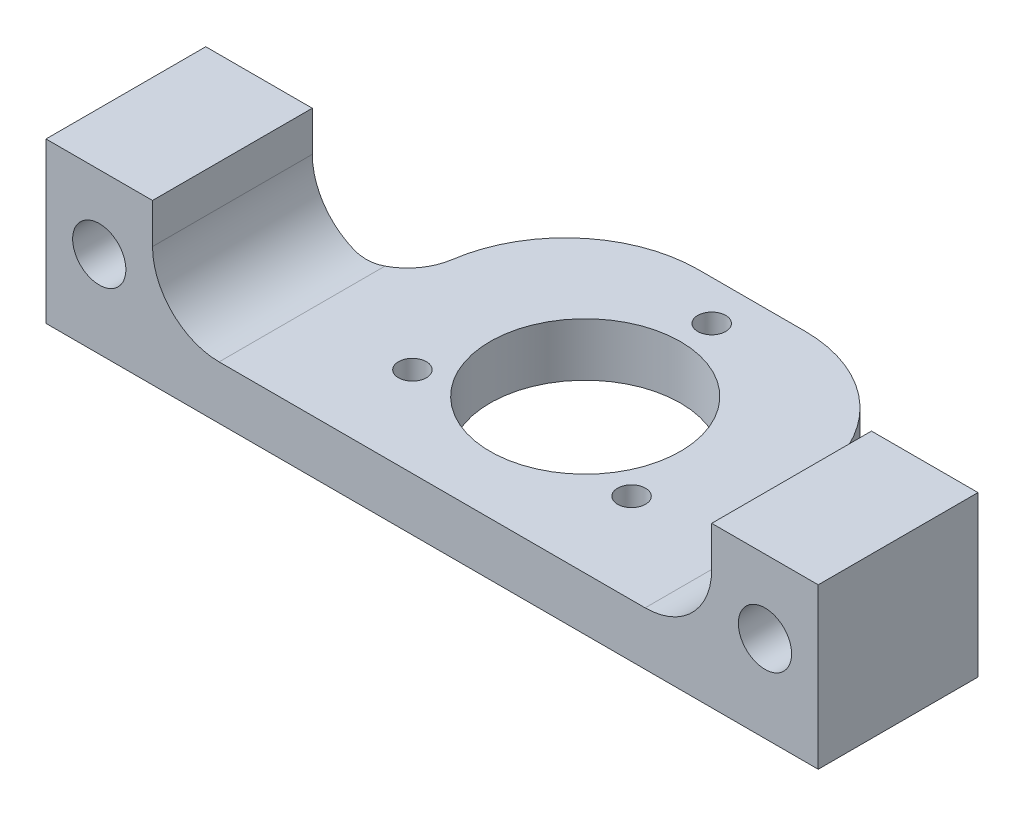
ISO-10303-21;
HEADER;
FILE_DESCRIPTION(('STEP AP214'),'2;1');
FILE_NAME('part.step','',(''),(''),'','','');
FILE_SCHEMA(('AUTOMOTIVE_DESIGN { 1 0 10303 214 1 1 1 1 }'));
ENDSEC;
DATA;
#1=APPLICATION_CONTEXT('core data for automotive mechanical design processes');
#2=APPLICATION_PROTOCOL_DEFINITION('international standard','automotive_design',2000,#1);
#3=PRODUCT_CONTEXT('',#1,'mechanical');
#4=PRODUCT('Part','Part','',(#3));
#5=PRODUCT_RELATED_PRODUCT_CATEGORY('part','',(#4));
#6=PRODUCT_DEFINITION_FORMATION('','',#4);
#7=PRODUCT_DEFINITION_CONTEXT('part definition',#1,'design');
#8=PRODUCT_DEFINITION('design','',#6,#7);
#9=PRODUCT_DEFINITION_SHAPE('','',#8);
#10=(LENGTH_UNIT() NAMED_UNIT(*) SI_UNIT(.MILLI.,.METRE.));
#11=(NAMED_UNIT(*) PLANE_ANGLE_UNIT() SI_UNIT($,.RADIAN.));
#12=(NAMED_UNIT(*) SI_UNIT($,.STERADIAN.) SOLID_ANGLE_UNIT());
#13=UNCERTAINTY_MEASURE_WITH_UNIT(LENGTH_MEASURE(1.E-05),#10,'distance_accuracy_value','');
#14=(GEOMETRIC_REPRESENTATION_CONTEXT(3) GLOBAL_UNCERTAINTY_ASSIGNED_CONTEXT((#13)) GLOBAL_UNIT_ASSIGNED_CONTEXT((#10,
#11,#12)) REPRESENTATION_CONTEXT('',''));
#15=CARTESIAN_POINT('',(0.,0.,0.));
#16=DIRECTION('',(0.,0.,1.));
#17=DIRECTION('',(1.,0.,0.));
#18=AXIS2_PLACEMENT_3D('',#15,#16,#17);
#19=CARTESIAN_POINT('',(0.,6.,3.));
#20=DIRECTION('',(0.,-1.,0.));
#21=DIRECTION('',(0.,0.,-1.));
#22=AXIS2_PLACEMENT_3D('',#19,#20,#21);
#23=CYLINDRICAL_SURFACE('',#22,1.05);
#24=CARTESIAN_POINT('',(0.,-2.,3.));
#25=DIRECTION('',(0.,-1.,0.));
#26=DIRECTION('',(0.,0.,-1.));
#27=AXIS2_PLACEMENT_3D('',#24,#25,#26);
#28=CIRCLE('',#27,1.05);
#29=CARTESIAN_POINT('',(0.,-2.,1.95));
#30=VERTEX_POINT('',#29);
#31=EDGE_CURVE('E194',#30,#30,#28,.T.);
#32=ORIENTED_EDGE('',*,*,#31,.F.);
#33=EDGE_LOOP('',(#32));
#34=FACE_BOUND('',#33,.T.);
#35=CARTESIAN_POINT('',(0.,-4.5,3.));
#36=DIRECTION('',(0.,-1.,0.));
#37=DIRECTION('',(0.,0.,-1.));
#38=AXIS2_PLACEMENT_3D('',#35,#36,#37);
#39=CIRCLE('',#38,1.05);
#40=CARTESIAN_POINT('',(0.,-4.5,1.95));
#41=VERTEX_POINT('',#40);
#42=EDGE_CURVE('E219',#41,#41,#39,.F.);
#43=ORIENTED_EDGE('',*,*,#42,.F.);
#44=EDGE_LOOP('',(#43));
#45=FACE_BOUND('',#44,.T.);
#46=ADVANCED_FACE('F33',(#34,#45),#23,.F.);
#47=CARTESIAN_POINT('',(8.2272413359522,6.,17.25));
#48=DIRECTION('',(0.,-1.,0.));
#49=DIRECTION('',(0.,0.,-1.));
#50=AXIS2_PLACEMENT_3D('',#47,#48,#49);
#51=CYLINDRICAL_SURFACE('',#50,1.05);
#52=CARTESIAN_POINT('',(8.2272413359522,-2.,17.25));
#53=DIRECTION('',(0.,-1.,0.));
#54=DIRECTION('',(0.,0.,-1.));
#55=AXIS2_PLACEMENT_3D('',#52,#53,#54);
#56=CIRCLE('',#55,1.05);
#57=CARTESIAN_POINT('',(8.2272413359522,-2.,16.2));
#58=VERTEX_POINT('',#57);
#59=EDGE_CURVE('E190',#58,#58,#56,.T.);
#60=ORIENTED_EDGE('',*,*,#59,.F.);
#61=EDGE_LOOP('',(#60));
#62=FACE_BOUND('',#61,.T.);
#63=CARTESIAN_POINT('',(8.2272413359522,-4.5,17.25));
#64=DIRECTION('',(0.,-1.,0.));
#65=DIRECTION('',(0.,0.,-1.));
#66=AXIS2_PLACEMENT_3D('',#63,#64,#65);
#67=CIRCLE('',#66,1.05);
#68=CARTESIAN_POINT('',(8.2272413359522,-4.5,16.2));
#69=VERTEX_POINT('',#68);
#70=EDGE_CURVE('E216',#69,#69,#67,.F.);
#71=ORIENTED_EDGE('',*,*,#70,.F.);
#72=EDGE_LOOP('',(#71));
#73=FACE_BOUND('',#72,.T.);
#74=ADVANCED_FACE('F275',(#62,#73),#51,.F.);
#75=CARTESIAN_POINT('',(-8.22724133595217,6.,17.25));
#76=DIRECTION('',(0.,-1.,0.));
#77=DIRECTION('',(0.,0.,-1.));
#78=AXIS2_PLACEMENT_3D('',#75,#76,#77);
#79=CYLINDRICAL_SURFACE('',#78,1.05);
#80=CARTESIAN_POINT('',(-8.22724133595217,-2.,17.25));
#81=DIRECTION('',(0.,-1.,0.));
#82=DIRECTION('',(0.,0.,-1.));
#83=AXIS2_PLACEMENT_3D('',#80,#81,#82);
#84=CIRCLE('',#83,1.05);
#85=CARTESIAN_POINT('',(-8.22724133595217,-2.,16.2));
#86=VERTEX_POINT('',#85);
#87=EDGE_CURVE('E187',#86,#86,#84,.T.);
#88=ORIENTED_EDGE('',*,*,#87,.F.);
#89=EDGE_LOOP('',(#88));
#90=FACE_BOUND('',#89,.T.);
#91=CARTESIAN_POINT('',(-8.22724133595217,-4.5,17.25));
#92=DIRECTION('',(0.,-1.,0.));
#93=DIRECTION('',(0.,0.,-1.));
#94=AXIS2_PLACEMENT_3D('',#91,#92,#93);
#95=CIRCLE('',#94,1.05);
#96=CARTESIAN_POINT('',(-8.22724133595217,-4.5,16.2));
#97=VERTEX_POINT('',#96);
#98=EDGE_CURVE('E212',#97,#97,#95,.F.);
#99=ORIENTED_EDGE('',*,*,#98,.F.);
#100=EDGE_LOOP('',(#99));
#101=FACE_BOUND('',#100,.T.);
#102=ADVANCED_FACE('F281',(#90,#101),#79,.F.);
#103=CARTESIAN_POINT('',(-29.,6.,24.));
#104=DIRECTION('',(0.,-1.,0.));
#105=DIRECTION('',(0.,0.,-1.));
#106=AXIS2_PLACEMENT_3D('',#103,#104,#105);
#107=PLANE('',#106);
#108=DIRECTION('',(0.,0.,1.));
#109=VECTOR('',#108,1.);
#110=CARTESIAN_POINT('',(-21.,6.,0.));
#111=LINE('',#110,#109);
#112=CARTESIAN_POINT('',(-21.,6.,12.));
#113=VERTEX_POINT('',#112);
#114=CARTESIAN_POINT('',(-21.,6.,24.));
#115=VERTEX_POINT('',#114);
#116=EDGE_CURVE('E412',#113,#115,#111,.T.);
#117=ORIENTED_EDGE('',*,*,#116,.F.);
#118=DIRECTION('',(-1.,0.,0.));
#119=VECTOR('',#118,1.);
#120=CARTESIAN_POINT('',(-29.,6.,12.));
#121=LINE('',#120,#119);
#122=CARTESIAN_POINT('',(-29.,6.,12.));
#123=VERTEX_POINT('',#122);
#124=EDGE_CURVE('E391',#113,#123,#121,.T.);
#125=ORIENTED_EDGE('',*,*,#124,.T.);
#126=DIRECTION('',(0.,0.,-1.));
#127=VECTOR('',#126,1.);
#128=CARTESIAN_POINT('',(-29.,6.,24.));
#129=LINE('',#128,#127);
#130=CARTESIAN_POINT('',(-29.,6.,24.));
#131=VERTEX_POINT('',#130);
#132=EDGE_CURVE('E178',#131,#123,#129,.T.);
#133=ORIENTED_EDGE('',*,*,#132,.F.);
#134=DIRECTION('',(-1.,0.,0.));
#135=VECTOR('',#134,1.);
#136=CARTESIAN_POINT('',(-29.,6.,24.));
#137=LINE('',#136,#135);
#138=EDGE_CURVE('E424',#115,#131,#137,.T.);
#139=ORIENTED_EDGE('',*,*,#138,.F.);
#140=EDGE_LOOP('',(#117,#125,#133,#139));
#141=FACE_BOUND('',#140,.T.);
#142=ADVANCED_FACE('F295',(#141),#107,.F.);
#143=CARTESIAN_POINT('',(0.,0.,24.));
#144=DIRECTION('',(0.,0.,-1.));
#145=DIRECTION('',(-1.,0.,0.));
#146=AXIS2_PLACEMENT_3D('',#143,#144,#145);
#147=PLANE('',#146);
#148=DIRECTION('',(1.,0.,0.));
#149=VECTOR('',#148,1.);
#150=CARTESIAN_POINT('',(-21.,-2.,24.));
#151=LINE('',#150,#149);
#152=CARTESIAN_POINT('',(-16.,-2.,24.));
#153=VERTEX_POINT('',#152);
#154=CARTESIAN_POINT('',(16.,-2.,24.));
#155=VERTEX_POINT('',#154);
#156=EDGE_CURVE('E409',#153,#155,#151,.T.);
#157=ORIENTED_EDGE('',*,*,#156,.F.);
#158=CARTESIAN_POINT('',(-16.,3.,24.));
#159=DIRECTION('',(0.,0.,-1.));
#160=DIRECTION('',(-1.,0.,0.));
#161=AXIS2_PLACEMENT_3D('',#158,#159,#160);
#162=CIRCLE('',#161,5.);
#163=CARTESIAN_POINT('',(-21.,3.,24.));
#164=VERTEX_POINT('',#163);
#165=EDGE_CURVE('E231',#153,#164,#162,.T.);
#166=ORIENTED_EDGE('',*,*,#165,.T.);
#167=DIRECTION('',(0.,-1.,0.));
#168=VECTOR('',#167,1.);
#169=CARTESIAN_POINT('',(-21.,6.,24.));
#170=LINE('',#169,#168);
#171=EDGE_CURVE('E402',#115,#164,#170,.T.);
#172=ORIENTED_EDGE('',*,*,#171,.F.);
#173=ORIENTED_EDGE('',*,*,#138,.T.);
#174=DIRECTION('',(0.,-1.,0.));
#175=VECTOR('',#174,1.);
#176=CARTESIAN_POINT('',(-29.,-6.,24.));
#177=LINE('',#176,#175);
#178=CARTESIAN_POINT('',(-29.,-6.,24.));
#179=VERTEX_POINT('',#178);
#180=EDGE_CURVE('E426',#131,#179,#177,.T.);
#181=ORIENTED_EDGE('',*,*,#180,.T.);
#182=DIRECTION('',(1.,0.,0.));
#183=VECTOR('',#182,1.);
#184=CARTESIAN_POINT('',(-29.,-6.,24.));
#185=LINE('',#184,#183);
#186=CARTESIAN_POINT('',(29.,-6.,24.));
#187=VERTEX_POINT('',#186);
#188=EDGE_CURVE('E428',#179,#187,#185,.T.);
#189=ORIENTED_EDGE('',*,*,#188,.T.);
#190=DIRECTION('',(0.,1.,0.));
#191=VECTOR('',#190,1.);
#192=CARTESIAN_POINT('',(29.,-6.,24.));
#193=LINE('',#192,#191);
#194=CARTESIAN_POINT('',(29.,6.,24.));
#195=VERTEX_POINT('',#194);
#196=EDGE_CURVE('E422',#187,#195,#193,.T.);
#197=ORIENTED_EDGE('',*,*,#196,.T.);
#198=CARTESIAN_POINT('',(21.,6.,24.));
#199=VERTEX_POINT('',#198);
#200=EDGE_CURVE('E175',#195,#199,#137,.T.);
#201=ORIENTED_EDGE('',*,*,#200,.T.);
#202=DIRECTION('',(0.,1.,0.));
#203=VECTOR('',#202,1.);
#204=CARTESIAN_POINT('',(21.,6.,24.));
#205=LINE('',#204,#203);
#206=CARTESIAN_POINT('',(21.,3.,24.));
#207=VERTEX_POINT('',#206);
#208=EDGE_CURVE('E406',#207,#199,#205,.T.);
#209=ORIENTED_EDGE('',*,*,#208,.F.);
#210=CARTESIAN_POINT('',(16.,3.,24.));
#211=DIRECTION('',(0.,0.,-1.));
#212=DIRECTION('',(-1.,0.,0.));
#213=AXIS2_PLACEMENT_3D('',#210,#211,#212);
#214=CIRCLE('',#213,5.);
#215=EDGE_CURVE('E236',#207,#155,#214,.T.);
#216=ORIENTED_EDGE('',*,*,#215,.T.);
#217=EDGE_LOOP('',(#157,#166,#172,#173,#181,#189,#197,#201,#209,#216));
#218=FACE_BOUND('',#217,.T.);
#219=CARTESIAN_POINT('',(-25.,0.5,24.));
#220=DIRECTION('',(0.,0.,1.));
#221=DIRECTION('',(1.,0.,0.));
#222=AXIS2_PLACEMENT_3D('',#219,#220,#221);
#223=CIRCLE('',#222,2.);
#224=CARTESIAN_POINT('',(-23.,0.5,24.));
#225=VERTEX_POINT('',#224);
#226=EDGE_CURVE('E418',#225,#225,#223,.T.);
#227=ORIENTED_EDGE('',*,*,#226,.F.);
#228=EDGE_LOOP('',(#227));
#229=FACE_BOUND('',#228,.T.);
#230=CARTESIAN_POINT('',(25.,0.5,24.));
#231=DIRECTION('',(0.,0.,1.));
#232=DIRECTION('',(1.,0.,0.));
#233=AXIS2_PLACEMENT_3D('',#230,#231,#232);
#234=CIRCLE('',#233,2.);
#235=CARTESIAN_POINT('',(27.,0.5,24.));
#236=VERTEX_POINT('',#235);
#237=EDGE_CURVE('E414',#236,#236,#234,.T.);
#238=ORIENTED_EDGE('',*,*,#237,.F.);
#239=EDGE_LOOP('',(#238));
#240=FACE_BOUND('',#239,.T.);
#241=ADVANCED_FACE('F325',(#218,#229,#240),#147,.F.);
#242=CARTESIAN_POINT('',(0.,0.,0.));
#243=DIRECTION('',(0.,0.,-1.));
#244=DIRECTION('',(-1.,0.,0.));
#245=AXIS2_PLACEMENT_3D('',#242,#243,#244);
#246=PLANE('',#245);
#247=DIRECTION('',(1.,0.,0.));
#248=VECTOR('',#247,1.);
#249=CARTESIAN_POINT('',(-21.,-2.,0.));
#250=LINE('',#249,#248);
#251=CARTESIAN_POINT('',(-4.00000000000001,-2.,0.));
#252=VERTEX_POINT('',#251);
#253=CARTESIAN_POINT('',(3.99999999999999,-2.,0.));
#254=VERTEX_POINT('',#253);
#255=EDGE_CURVE('E403',#252,#254,#250,.T.);
#256=ORIENTED_EDGE('',*,*,#255,.T.);
#257=DIRECTION('',(0.,-1.,0.));
#258=VECTOR('',#257,1.);
#259=CARTESIAN_POINT('',(4.,-6.,0.));
#260=LINE('',#259,#258);
#261=CARTESIAN_POINT('',(3.99999999999999,-6.,0.));
#262=VERTEX_POINT('',#261);
#263=EDGE_CURVE('E180',#254,#262,#260,.T.);
#264=ORIENTED_EDGE('',*,*,#263,.T.);
#265=DIRECTION('',(1.,0.,0.));
#266=VECTOR('',#265,1.);
#267=CARTESIAN_POINT('',(-29.,-6.,0.));
#268=LINE('',#267,#266);
#269=CARTESIAN_POINT('',(-4.00000000000001,-6.,0.));
#270=VERTEX_POINT('',#269);
#271=EDGE_CURVE('E421',#270,#262,#268,.T.);
#272=ORIENTED_EDGE('',*,*,#271,.F.);
#273=DIRECTION('',(0.,-1.,0.));
#274=VECTOR('',#273,1.);
#275=CARTESIAN_POINT('',(-4.,-2.,0.));
#276=LINE('',#275,#274);
#277=EDGE_CURVE('E177',#270,#252,#276,.F.);
#278=ORIENTED_EDGE('',*,*,#277,.T.);
#279=EDGE_LOOP('',(#256,#264,#272,#278));
#280=FACE_BOUND('',#279,.T.);
#281=ADVANCED_FACE('F328',(#280),#246,.T.);
#282=CARTESIAN_POINT('',(29.,-6.,24.));
#283=DIRECTION('',(-1.,0.,0.));
#284=DIRECTION('',(0.,0.,1.));
#285=AXIS2_PLACEMENT_3D('',#282,#283,#284);
#286=PLANE('',#285);
#287=DIRECTION('',(0.,0.,-1.));
#288=VECTOR('',#287,1.);
#289=CARTESIAN_POINT('',(29.,-6.,24.));
#290=LINE('',#289,#288);
#291=CARTESIAN_POINT('',(29.,-6.,12.));
#292=VERTEX_POINT('',#291);
#293=EDGE_CURVE('E171',#187,#292,#290,.T.);
#294=ORIENTED_EDGE('',*,*,#293,.T.);
#295=DIRECTION('',(0.,-1.,0.));
#296=VECTOR('',#295,1.);
#297=CARTESIAN_POINT('',(29.,6.,12.));
#298=LINE('',#297,#296);
#299=CARTESIAN_POINT('',(29.,6.,12.));
#300=VERTEX_POINT('',#299);
#301=EDGE_CURVE('E154',#300,#292,#298,.T.);
#302=ORIENTED_EDGE('',*,*,#301,.F.);
#303=DIRECTION('',(0.,0.,-1.));
#304=VECTOR('',#303,1.);
#305=CARTESIAN_POINT('',(29.,6.,24.));
#306=LINE('',#305,#304);
#307=EDGE_CURVE('E169',#195,#300,#306,.T.);
#308=ORIENTED_EDGE('',*,*,#307,.F.);
#309=ORIENTED_EDGE('',*,*,#196,.F.);
#310=EDGE_LOOP('',(#294,#302,#308,#309));
#311=FACE_BOUND('',#310,.T.);
#312=ADVANCED_FACE('F167',(#311),#286,.F.);
#313=ORIENTED_EDGE('',*,*,#307,.T.);
#314=DIRECTION('',(-1.,0.,0.));
#315=VECTOR('',#314,1.);
#316=CARTESIAN_POINT('',(29.,6.,12.));
#317=LINE('',#316,#315);
#318=CARTESIAN_POINT('',(21.,6.,12.));
#319=VERTEX_POINT('',#318);
#320=EDGE_CURVE('E150',#300,#319,#317,.T.);
#321=ORIENTED_EDGE('',*,*,#320,.T.);
#322=DIRECTION('',(0.,0.,1.));
#323=VECTOR('',#322,1.);
#324=CARTESIAN_POINT('',(21.,6.,0.));
#325=LINE('',#324,#323);
#326=EDGE_CURVE('E405',#319,#199,#325,.T.);
#327=ORIENTED_EDGE('',*,*,#326,.T.);
#328=ORIENTED_EDGE('',*,*,#200,.F.);
#329=EDGE_LOOP('',(#313,#321,#327,#328));
#330=FACE_BOUND('',#329,.T.);
#331=ADVANCED_FACE('F173',(#330),#107,.F.);
#332=CARTESIAN_POINT('',(-29.,-6.,24.));
#333=DIRECTION('',(1.,0.,0.));
#334=DIRECTION('',(0.,0.,-1.));
#335=AXIS2_PLACEMENT_3D('',#332,#333,#334);
#336=PLANE('',#335);
#337=ORIENTED_EDGE('',*,*,#132,.T.);
#338=DIRECTION('',(0.,-1.,0.));
#339=VECTOR('',#338,1.);
#340=CARTESIAN_POINT('',(-29.,6.,12.));
#341=LINE('',#340,#339);
#342=CARTESIAN_POINT('',(-29.,-6.,12.));
#343=VERTEX_POINT('',#342);
#344=EDGE_CURVE('E394',#123,#343,#341,.T.);
#345=ORIENTED_EDGE('',*,*,#344,.T.);
#346=DIRECTION('',(0.,0.,-1.));
#347=VECTOR('',#346,1.);
#348=CARTESIAN_POINT('',(-29.,-6.,24.));
#349=LINE('',#348,#347);
#350=EDGE_CURVE('E183',#179,#343,#349,.T.);
#351=ORIENTED_EDGE('',*,*,#350,.F.);
#352=ORIENTED_EDGE('',*,*,#180,.F.);
#353=EDGE_LOOP('',(#337,#345,#351,#352));
#354=FACE_BOUND('',#353,.T.);
#355=ADVANCED_FACE('F335',(#354),#336,.F.);
#356=CARTESIAN_POINT('',(-29.,-6.,24.));
#357=DIRECTION('',(0.,1.,0.));
#358=DIRECTION('',(0.,0.,1.));
#359=AXIS2_PLACEMENT_3D('',#356,#357,#358);
#360=PLANE('',#359);
#361=CARTESIAN_POINT('',(8.2272413359522,-6.,17.25));
#362=DIRECTION('',(0.,-1.,0.));
#363=DIRECTION('',(0.,0.,-1.));
#364=AXIS2_PLACEMENT_3D('',#361,#362,#363);
#365=CIRCLE('',#364,2.2);
#366=CARTESIAN_POINT('',(8.2272413359522,-6.,15.05));
#367=VERTEX_POINT('',#366);
#368=EDGE_CURVE('E649',#367,#367,#365,.T.);
#369=ORIENTED_EDGE('',*,*,#368,.F.);
#370=EDGE_LOOP('',(#369));
#371=FACE_BOUND('',#370,.T.);
#372=CARTESIAN_POINT('',(0.,-6.,3.));
#373=DIRECTION('',(0.,-1.,0.));
#374=DIRECTION('',(0.,0.,-1.));
#375=AXIS2_PLACEMENT_3D('',#372,#373,#374);
#376=CIRCLE('',#375,2.2);
#377=CARTESIAN_POINT('',(0.,-6.,0.8));
#378=VERTEX_POINT('',#377);
#379=EDGE_CURVE('E650',#378,#378,#376,.T.);
#380=ORIENTED_EDGE('',*,*,#379,.F.);
#381=EDGE_LOOP('',(#380));
#382=FACE_BOUND('',#381,.T.);
#383=CARTESIAN_POINT('',(-8.22724133595217,-6.,17.25));
#384=DIRECTION('',(0.,-1.,0.));
#385=DIRECTION('',(0.,0.,-1.));
#386=AXIS2_PLACEMENT_3D('',#383,#384,#385);
#387=CIRCLE('',#386,2.2);
#388=CARTESIAN_POINT('',(-8.22724133595217,-6.,15.05));
#389=VERTEX_POINT('',#388);
#390=EDGE_CURVE('E223',#389,#389,#387,.T.);
#391=ORIENTED_EDGE('',*,*,#390,.F.);
#392=EDGE_LOOP('',(#391));
#393=FACE_BOUND('',#392,.T.);
#394=CARTESIAN_POINT('',(0.,-6.,12.5));
#395=DIRECTION('',(0.,-1.,0.));
#396=DIRECTION('',(0.,0.,-1.));
#397=AXIS2_PLACEMENT_3D('',#394,#395,#396);
#398=CIRCLE('',#397,7.15);
#399=CARTESIAN_POINT('',(0.,-6.,5.35000000000001));
#400=VERTEX_POINT('',#399);
#401=EDGE_CURVE('E195',#400,#400,#398,.T.);
#402=ORIENTED_EDGE('',*,*,#401,.F.);
#403=EDGE_LOOP('',(#402));
#404=FACE_BOUND('',#403,.T.);
#405=ORIENTED_EDGE('',*,*,#271,.T.);
#406=CARTESIAN_POINT('',(4.,-6.,10.));
#407=DIRECTION('',(0.,1.,0.));
#408=DIRECTION('',(0.,0.,1.));
#409=AXIS2_PLACEMENT_3D('',#406,#407,#408);
#410=CIRCLE('',#409,10.);
#411=CARTESIAN_POINT('',(13.8974331861079,-6.,8.57142857142857));
#412=VERTEX_POINT('',#411);
#413=EDGE_CURVE('E204',#262,#412,#410,.F.);
#414=ORIENTED_EDGE('',*,*,#413,.T.);
#415=CARTESIAN_POINT('',(17.856406460551,-6.,8.));
#416=DIRECTION('',(0.,1.,0.));
#417=DIRECTION('',(0.,0.,1.));
#418=AXIS2_PLACEMENT_3D('',#415,#416,#417);
#419=CIRCLE('',#418,4.);
#420=CARTESIAN_POINT('',(17.856406460551,-6.,12.));
#421=VERTEX_POINT('',#420);
#422=EDGE_CURVE('E250',#412,#421,#419,.T.);
#423=ORIENTED_EDGE('',*,*,#422,.T.);
#424=DIRECTION('',(-1.,0.,0.));
#425=VECTOR('',#424,1.);
#426=CARTESIAN_POINT('',(29.,-6.,12.));
#427=LINE('',#426,#425);
#428=EDGE_CURVE('E162',#292,#421,#427,.T.);
#429=ORIENTED_EDGE('',*,*,#428,.F.);
#430=ORIENTED_EDGE('',*,*,#293,.F.);
#431=ORIENTED_EDGE('',*,*,#188,.F.);
#432=ORIENTED_EDGE('',*,*,#350,.T.);
#433=DIRECTION('',(-1.,0.,0.));
#434=VECTOR('',#433,1.);
#435=CARTESIAN_POINT('',(-29.,-6.,12.));
#436=LINE('',#435,#434);
#437=CARTESIAN_POINT('',(-17.856406460551,-6.,12.));
#438=VERTEX_POINT('',#437);
#439=EDGE_CURVE('E390',#438,#343,#436,.T.);
#440=ORIENTED_EDGE('',*,*,#439,.F.);
#441=CARTESIAN_POINT('',(-17.856406460551,-6.,8.));
#442=DIRECTION('',(0.,1.,0.));
#443=DIRECTION('',(0.,0.,1.));
#444=AXIS2_PLACEMENT_3D('',#441,#442,#443);
#445=CIRCLE('',#444,4.);
#446=CARTESIAN_POINT('',(-13.8974331861079,-6.,8.57142857142857));
#447=VERTEX_POINT('',#446);
#448=EDGE_CURVE('E371',#438,#447,#445,.T.);
#449=ORIENTED_EDGE('',*,*,#448,.T.);
#450=CARTESIAN_POINT('',(-4.,-6.,10.));
#451=DIRECTION('',(0.,1.,0.));
#452=DIRECTION('',(0.,0.,1.));
#453=AXIS2_PLACEMENT_3D('',#450,#451,#452);
#454=CIRCLE('',#453,10.);
#455=EDGE_CURVE('E202',#447,#270,#454,.F.);
#456=ORIENTED_EDGE('',*,*,#455,.T.);
#457=EDGE_LOOP('',(#405,#414,#423,#429,#430,#431,#432,#440,#449,#456));
#458=FACE_BOUND('',#457,.T.);
#459=ADVANCED_FACE('F323',(#371,#382,#393,#404,#458),#360,.F.);
#460=CARTESIAN_POINT('',(-25.,0.5,24.));
#461=DIRECTION('',(0.,0.,-1.));
#462=DIRECTION('',(-1.,0.,0.));
#463=AXIS2_PLACEMENT_3D('',#460,#461,#462);
#464=CYLINDRICAL_SURFACE('',#463,2.);
#465=CARTESIAN_POINT('',(-25.,0.5,12.));
#466=DIRECTION('',(0.,0.,1.));
#467=DIRECTION('',(1.,0.,0.));
#468=AXIS2_PLACEMENT_3D('',#465,#466,#467);
#469=CIRCLE('',#468,2.);
#470=CARTESIAN_POINT('',(-23.,0.5,12.));
#471=VERTEX_POINT('',#470);
#472=EDGE_CURVE('E399',#471,#471,#469,.T.);
#473=ORIENTED_EDGE('',*,*,#472,.F.);
#474=EDGE_LOOP('',(#473));
#475=FACE_BOUND('',#474,.T.);
#476=ORIENTED_EDGE('',*,*,#226,.T.);
#477=EDGE_LOOP('',(#476));
#478=FACE_BOUND('',#477,.T.);
#479=ADVANCED_FACE('F319',(#475,#478),#464,.F.);
#480=CARTESIAN_POINT('',(25.,0.5,24.));
#481=DIRECTION('',(0.,0.,-1.));
#482=DIRECTION('',(-1.,0.,0.));
#483=AXIS2_PLACEMENT_3D('',#480,#481,#482);
#484=CYLINDRICAL_SURFACE('',#483,2.);
#485=CARTESIAN_POINT('',(25.,0.5,12.));
#486=DIRECTION('',(0.,0.,1.));
#487=DIRECTION('',(1.,0.,0.));
#488=AXIS2_PLACEMENT_3D('',#485,#486,#487);
#489=CIRCLE('',#488,2.);
#490=CARTESIAN_POINT('',(27.,0.5,12.));
#491=VERTEX_POINT('',#490);
#492=EDGE_CURVE('E387',#491,#491,#489,.T.);
#493=ORIENTED_EDGE('',*,*,#492,.F.);
#494=EDGE_LOOP('',(#493));
#495=FACE_BOUND('',#494,.T.);
#496=ORIENTED_EDGE('',*,*,#237,.T.);
#497=EDGE_LOOP('',(#496));
#498=FACE_BOUND('',#497,.T.);
#499=ADVANCED_FACE('F315',(#495,#498),#484,.F.);
#500=CARTESIAN_POINT('',(-21.,6.,0.));
#501=DIRECTION('',(-1.,0.,0.));
#502=DIRECTION('',(0.,0.,1.));
#503=AXIS2_PLACEMENT_3D('',#500,#501,#502);
#504=PLANE('',#503);
#505=ORIENTED_EDGE('',*,*,#171,.T.);
#506=DIRECTION('',(0.,0.,1.));
#507=VECTOR('',#506,1.);
#508=CARTESIAN_POINT('',(-21.,3.,12.));
#509=LINE('',#508,#507);
#510=CARTESIAN_POINT('',(-21.,3.,12.));
#511=VERTEX_POINT('',#510);
#512=EDGE_CURVE('E226',#164,#511,#509,.F.);
#513=ORIENTED_EDGE('',*,*,#512,.T.);
#514=DIRECTION('',(0.,1.,0.));
#515=VECTOR('',#514,1.);
#516=CARTESIAN_POINT('',(-21.,6.,12.));
#517=LINE('',#516,#515);
#518=EDGE_CURVE('E368',#511,#113,#517,.T.);
#519=ORIENTED_EDGE('',*,*,#518,.T.);
#520=ORIENTED_EDGE('',*,*,#116,.T.);
#521=EDGE_LOOP('',(#505,#513,#519,#520));
#522=FACE_BOUND('',#521,.T.);
#523=ADVANCED_FACE('F308',(#522),#504,.F.);
#524=CARTESIAN_POINT('',(21.,6.,0.));
#525=DIRECTION('',(1.,0.,0.));
#526=DIRECTION('',(0.,0.,-1.));
#527=AXIS2_PLACEMENT_3D('',#524,#525,#526);
#528=PLANE('',#527);
#529=DIRECTION('',(0.,-1.,0.));
#530=VECTOR('',#529,1.);
#531=CARTESIAN_POINT('',(21.,6.,12.));
#532=LINE('',#531,#530);
#533=CARTESIAN_POINT('',(21.,3.,12.));
#534=VERTEX_POINT('',#533);
#535=EDGE_CURVE('E157',#319,#534,#532,.T.);
#536=ORIENTED_EDGE('',*,*,#535,.T.);
#537=DIRECTION('',(0.,0.,1.));
#538=VECTOR('',#537,1.);
#539=CARTESIAN_POINT('',(21.,3.,24.));
#540=LINE('',#539,#538);
#541=EDGE_CURVE('E228',#534,#207,#540,.T.);
#542=ORIENTED_EDGE('',*,*,#541,.T.);
#543=ORIENTED_EDGE('',*,*,#208,.T.);
#544=ORIENTED_EDGE('',*,*,#326,.F.);
#545=EDGE_LOOP('',(#536,#542,#543,#544));
#546=FACE_BOUND('',#545,.T.);
#547=ADVANCED_FACE('F305',(#546),#528,.F.);
#548=CARTESIAN_POINT('',(-21.,-2.,0.));
#549=DIRECTION('',(0.,-1.,0.));
#550=DIRECTION('',(0.,0.,-1.));
#551=AXIS2_PLACEMENT_3D('',#548,#549,#550);
#552=PLANE('',#551);
#553=ORIENTED_EDGE('',*,*,#59,.T.);
#554=EDGE_LOOP('',(#553));
#555=FACE_BOUND('',#554,.T.);
#556=ORIENTED_EDGE('',*,*,#31,.T.);
#557=EDGE_LOOP('',(#556));
#558=FACE_BOUND('',#557,.T.);
#559=CARTESIAN_POINT('',(0.,-2.,12.5));
#560=DIRECTION('',(0.,-1.,0.));
#561=DIRECTION('',(0.,0.,-1.));
#562=AXIS2_PLACEMENT_3D('',#559,#560,#561);
#563=CIRCLE('',#562,7.15);
#564=CARTESIAN_POINT('',(0.,-2.,5.35000000000001));
#565=VERTEX_POINT('',#564);
#566=EDGE_CURVE('E191',#565,#565,#563,.T.);
#567=ORIENTED_EDGE('',*,*,#566,.T.);
#568=EDGE_LOOP('',(#567));
#569=FACE_BOUND('',#568,.T.);
#570=ORIENTED_EDGE('',*,*,#87,.T.);
#571=EDGE_LOOP('',(#570));
#572=FACE_BOUND('',#571,.T.);
#573=CARTESIAN_POINT('',(-4.,-2.,10.));
#574=DIRECTION('',(0.,-1.,0.));
#575=DIRECTION('',(0.,0.,-1.));
#576=AXIS2_PLACEMENT_3D('',#573,#574,#575);
#577=CIRCLE('',#576,10.);
#578=CARTESIAN_POINT('',(-13.8974331861079,-2.,8.57142857142857));
#579=VERTEX_POINT('',#578);
#580=EDGE_CURVE('E207',#252,#579,#577,.F.);
#581=ORIENTED_EDGE('',*,*,#580,.T.);
#582=CARTESIAN_POINT('',(-17.856406460551,-2.,8.));
#583=DIRECTION('',(0.,-1.,0.));
#584=DIRECTION('',(0.,0.,-1.));
#585=AXIS2_PLACEMENT_3D('',#582,#583,#584);
#586=CIRCLE('',#585,4.);
#587=CARTESIAN_POINT('',(-16.,-2.,11.5431278629517));
#588=VERTEX_POINT('',#587);
#589=EDGE_CURVE('E46',#579,#588,#586,.T.);
#590=ORIENTED_EDGE('',*,*,#589,.T.);
#591=DIRECTION('',(0.,0.,1.));
#592=VECTOR('',#591,1.);
#593=CARTESIAN_POINT('',(-16.,-2.,24.));
#594=LINE('',#593,#592);
#595=EDGE_CURVE('E52',#588,#153,#594,.T.);
#596=ORIENTED_EDGE('',*,*,#595,.T.);
#597=ORIENTED_EDGE('',*,*,#156,.T.);
#598=DIRECTION('',(0.,0.,1.));
#599=VECTOR('',#598,1.);
#600=CARTESIAN_POINT('',(16.,-2.,12.));
#601=LINE('',#600,#599);
#602=CARTESIAN_POINT('',(16.,-2.,11.5431278629517));
#603=VERTEX_POINT('',#602);
#604=EDGE_CURVE('E60',#155,#603,#601,.F.);
#605=ORIENTED_EDGE('',*,*,#604,.T.);
#606=CARTESIAN_POINT('',(17.856406460551,-2.,8.));
#607=DIRECTION('',(0.,-1.,0.));
#608=DIRECTION('',(0.,0.,-1.));
#609=AXIS2_PLACEMENT_3D('',#606,#607,#608);
#610=CIRCLE('',#609,4.);
#611=CARTESIAN_POINT('',(13.8974331861079,-2.,8.57142857142857));
#612=VERTEX_POINT('',#611);
#613=EDGE_CURVE('E258',#603,#612,#610,.T.);
#614=ORIENTED_EDGE('',*,*,#613,.T.);
#615=CARTESIAN_POINT('',(4.,-2.,10.));
#616=DIRECTION('',(0.,-1.,0.));
#617=DIRECTION('',(0.,0.,-1.));
#618=AXIS2_PLACEMENT_3D('',#615,#616,#617);
#619=CIRCLE('',#618,10.);
#620=EDGE_CURVE('E210',#612,#254,#619,.F.);
#621=ORIENTED_EDGE('',*,*,#620,.T.);
#622=ORIENTED_EDGE('',*,*,#255,.F.);
#623=EDGE_LOOP('',(#581,#590,#596,#597,#605,#614,#621,#622));
#624=FACE_BOUND('',#623,.T.);
#625=ADVANCED_FACE('F303',(#555,#558,#569,#572,#624),#552,.F.);
#626=CARTESIAN_POINT('',(-29.,6.,12.));
#627=DIRECTION('',(0.,0.,1.));
#628=DIRECTION('',(1.,0.,0.));
#629=AXIS2_PLACEMENT_3D('',#626,#627,#628);
#630=PLANE('',#629);
#631=ORIENTED_EDGE('',*,*,#472,.T.);
#632=EDGE_LOOP('',(#631));
#633=FACE_BOUND('',#632,.T.);
#634=CARTESIAN_POINT('',(-16.,3.,12.));
#635=DIRECTION('',(0.,0.,1.));
#636=DIRECTION('',(1.,0.,0.));
#637=AXIS2_PLACEMENT_3D('',#634,#635,#636);
#638=CIRCLE('',#637,5.);
#639=CARTESIAN_POINT('',(-17.856406460551,-1.6426021855447,12.));
#640=VERTEX_POINT('',#639);
#641=EDGE_CURVE('E233',#511,#640,#638,.T.);
#642=ORIENTED_EDGE('',*,*,#641,.T.);
#643=DIRECTION('',(0.,1.,0.));
#644=VECTOR('',#643,1.);
#645=CARTESIAN_POINT('',(-17.856406460551,6.,12.));
#646=LINE('',#645,#644);
#647=EDGE_CURVE('E245',#640,#438,#646,.F.);
#648=ORIENTED_EDGE('',*,*,#647,.T.);
#649=ORIENTED_EDGE('',*,*,#439,.T.);
#650=ORIENTED_EDGE('',*,*,#344,.F.);
#651=ORIENTED_EDGE('',*,*,#124,.F.);
#652=ORIENTED_EDGE('',*,*,#518,.F.);
#653=EDGE_LOOP('',(#642,#648,#649,#650,#651,#652));
#654=FACE_BOUND('',#653,.T.);
#655=ADVANCED_FACE('F299',(#633,#654),#630,.F.);
#656=CARTESIAN_POINT('',(29.,6.,12.));
#657=DIRECTION('',(0.,0.,1.));
#658=DIRECTION('',(1.,0.,0.));
#659=AXIS2_PLACEMENT_3D('',#656,#657,#658);
#660=PLANE('',#659);
#661=ORIENTED_EDGE('',*,*,#492,.T.);
#662=EDGE_LOOP('',(#661));
#663=FACE_BOUND('',#662,.T.);
#664=ORIENTED_EDGE('',*,*,#428,.T.);
#665=DIRECTION('',(0.,1.,0.));
#666=VECTOR('',#665,1.);
#667=CARTESIAN_POINT('',(17.856406460551,6.,12.));
#668=LINE('',#667,#666);
#669=CARTESIAN_POINT('',(17.856406460551,-1.6426021855447,12.));
#670=VERTEX_POINT('',#669);
#671=EDGE_CURVE('E243',#421,#670,#668,.T.);
#672=ORIENTED_EDGE('',*,*,#671,.T.);
#673=CARTESIAN_POINT('',(16.,3.,12.));
#674=DIRECTION('',(0.,0.,1.));
#675=DIRECTION('',(1.,0.,0.));
#676=AXIS2_PLACEMENT_3D('',#673,#674,#675);
#677=CIRCLE('',#676,5.);
#678=EDGE_CURVE('E238',#670,#534,#677,.T.);
#679=ORIENTED_EDGE('',*,*,#678,.T.);
#680=ORIENTED_EDGE('',*,*,#535,.F.);
#681=ORIENTED_EDGE('',*,*,#320,.F.);
#682=ORIENTED_EDGE('',*,*,#301,.T.);
#683=EDGE_LOOP('',(#664,#672,#679,#680,#681,#682));
#684=FACE_BOUND('',#683,.T.);
#685=ADVANCED_FACE('F153',(#663,#684),#660,.F.);
#686=CARTESIAN_POINT('',(0.,6.,12.5));
#687=DIRECTION('',(0.,-1.,0.));
#688=DIRECTION('',(0.,0.,-1.));
#689=AXIS2_PLACEMENT_3D('',#686,#687,#688);
#690=CYLINDRICAL_SURFACE('',#689,7.15);
#691=ORIENTED_EDGE('',*,*,#401,.T.);
#692=EDGE_LOOP('',(#691));
#693=FACE_BOUND('',#692,.T.);
#694=ORIENTED_EDGE('',*,*,#566,.F.);
#695=EDGE_LOOP('',(#694));
#696=FACE_BOUND('',#695,.T.);
#697=ADVANCED_FACE('F288',(#693,#696),#690,.F.);
#698=CARTESIAN_POINT('',(4.,0.,10.));
#699=DIRECTION('',(0.,1.,0.));
#700=DIRECTION('',(0.,0.,1.));
#701=AXIS2_PLACEMENT_3D('',#698,#699,#700);
#702=CYLINDRICAL_SURFACE('',#701,10.);
#703=ORIENTED_EDGE('',*,*,#620,.F.);
#704=DIRECTION('',(0.,1.,0.));
#705=VECTOR('',#704,1.);
#706=CARTESIAN_POINT('',(13.8974331861079,0.,8.57142857142857));
#707=LINE('',#706,#705);
#708=EDGE_CURVE('E240',#612,#412,#707,.F.);
#709=ORIENTED_EDGE('',*,*,#708,.T.);
#710=ORIENTED_EDGE('',*,*,#413,.F.);
#711=ORIENTED_EDGE('',*,*,#263,.F.);
#712=EDGE_LOOP('',(#703,#709,#710,#711));
#713=FACE_BOUND('',#712,.T.);
#714=ADVANCED_FACE('F291',(#713),#702,.T.);
#715=CARTESIAN_POINT('',(-4.,6.,10.));
#716=DIRECTION('',(0.,1.,0.));
#717=DIRECTION('',(0.,0.,1.));
#718=AXIS2_PLACEMENT_3D('',#715,#716,#717);
#719=CYLINDRICAL_SURFACE('',#718,10.);
#720=ORIENTED_EDGE('',*,*,#455,.F.);
#721=DIRECTION('',(0.,1.,0.));
#722=VECTOR('',#721,1.);
#723=CARTESIAN_POINT('',(-13.8974331861079,6.,8.57142857142857));
#724=LINE('',#723,#722);
#725=EDGE_CURVE('E248',#447,#579,#724,.T.);
#726=ORIENTED_EDGE('',*,*,#725,.T.);
#727=ORIENTED_EDGE('',*,*,#580,.F.);
#728=ORIENTED_EDGE('',*,*,#277,.F.);
#729=EDGE_LOOP('',(#720,#726,#727,#728));
#730=FACE_BOUND('',#729,.T.);
#731=ADVANCED_FACE('F346',(#730),#719,.T.);
#732=CARTESIAN_POINT('',(-8.22724133595217,-4.5,17.25));
#733=DIRECTION('',(0.,-1.,0.));
#734=DIRECTION('',(0.,0.,-1.));
#735=AXIS2_PLACEMENT_3D('',#732,#733,#734);
#736=PLANE('',#735);
#737=CARTESIAN_POINT('',(-8.22724133595217,-4.5,17.25));
#738=DIRECTION('',(0.,-1.,0.));
#739=DIRECTION('',(0.,0.,-1.));
#740=AXIS2_PLACEMENT_3D('',#737,#738,#739);
#741=CIRCLE('',#740,2.2);
#742=CARTESIAN_POINT('',(-8.22724133595217,-4.5,15.05));
#743=VERTEX_POINT('',#742);
#744=EDGE_CURVE('E215',#743,#743,#741,.T.);
#745=ORIENTED_EDGE('',*,*,#744,.T.);
#746=EDGE_LOOP('',(#745));
#747=FACE_BOUND('',#746,.T.);
#748=ORIENTED_EDGE('',*,*,#98,.T.);
#749=EDGE_LOOP('',(#748));
#750=FACE_BOUND('',#749,.T.);
#751=ADVANCED_FACE('F349',(#747,#750),#736,.T.);
#752=CARTESIAN_POINT('',(-8.22724133595217,-4.5,17.25));
#753=DIRECTION('',(0.,-1.,0.));
#754=DIRECTION('',(0.,0.,-1.));
#755=AXIS2_PLACEMENT_3D('',#752,#753,#754);
#756=CYLINDRICAL_SURFACE('',#755,2.2);
#757=ORIENTED_EDGE('',*,*,#744,.F.);
#758=EDGE_LOOP('',(#757));
#759=FACE_BOUND('',#758,.T.);
#760=ORIENTED_EDGE('',*,*,#390,.T.);
#761=EDGE_LOOP('',(#760));
#762=FACE_BOUND('',#761,.T.);
#763=ADVANCED_FACE('F528',(#759,#762),#756,.F.);
#764=CARTESIAN_POINT('',(8.2272413359522,-4.5,17.25));
#765=DIRECTION('',(0.,-1.,0.));
#766=DIRECTION('',(0.,0.,-1.));
#767=AXIS2_PLACEMENT_3D('',#764,#765,#766);
#768=PLANE('',#767);
#769=CARTESIAN_POINT('',(8.2272413359522,-4.5,17.25));
#770=DIRECTION('',(0.,-1.,0.));
#771=DIRECTION('',(0.,0.,-1.));
#772=AXIS2_PLACEMENT_3D('',#769,#770,#771);
#773=CIRCLE('',#772,2.2);
#774=CARTESIAN_POINT('',(8.2272413359522,-4.5,15.05));
#775=VERTEX_POINT('',#774);
#776=EDGE_CURVE('E220',#775,#775,#773,.T.);
#777=ORIENTED_EDGE('',*,*,#776,.T.);
#778=EDGE_LOOP('',(#777));
#779=FACE_BOUND('',#778,.T.);
#780=ORIENTED_EDGE('',*,*,#70,.T.);
#781=EDGE_LOOP('',(#780));
#782=FACE_BOUND('',#781,.T.);
#783=ADVANCED_FACE('F536',(#779,#782),#768,.T.);
#784=CARTESIAN_POINT('',(8.2272413359522,-4.5,17.25));
#785=DIRECTION('',(0.,-1.,0.));
#786=DIRECTION('',(0.,0.,-1.));
#787=AXIS2_PLACEMENT_3D('',#784,#785,#786);
#788=CYLINDRICAL_SURFACE('',#787,2.2);
#789=ORIENTED_EDGE('',*,*,#776,.F.);
#790=EDGE_LOOP('',(#789));
#791=FACE_BOUND('',#790,.T.);
#792=ORIENTED_EDGE('',*,*,#368,.T.);
#793=EDGE_LOOP('',(#792));
#794=FACE_BOUND('',#793,.T.);
#795=ADVANCED_FACE('F543',(#791,#794),#788,.F.);
#796=CARTESIAN_POINT('',(0.,-4.5,3.));
#797=DIRECTION('',(0.,-1.,0.));
#798=DIRECTION('',(0.,0.,-1.));
#799=AXIS2_PLACEMENT_3D('',#796,#797,#798);
#800=PLANE('',#799);
#801=CARTESIAN_POINT('',(0.,-4.5,3.));
#802=DIRECTION('',(0.,-1.,0.));
#803=DIRECTION('',(0.,0.,-1.));
#804=AXIS2_PLACEMENT_3D('',#801,#802,#803);
#805=CIRCLE('',#804,2.2);
#806=CARTESIAN_POINT('',(0.,-4.5,0.8));
#807=VERTEX_POINT('',#806);
#808=EDGE_CURVE('E647',#807,#807,#805,.T.);
#809=ORIENTED_EDGE('',*,*,#808,.T.);
#810=EDGE_LOOP('',(#809));
#811=FACE_BOUND('',#810,.T.);
#812=ORIENTED_EDGE('',*,*,#42,.T.);
#813=EDGE_LOOP('',(#812));
#814=FACE_BOUND('',#813,.T.);
#815=ADVANCED_FACE('F357',(#811,#814),#800,.T.);
#816=CARTESIAN_POINT('',(0.,-4.5,3.));
#817=DIRECTION('',(0.,-1.,0.));
#818=DIRECTION('',(0.,0.,-1.));
#819=AXIS2_PLACEMENT_3D('',#816,#817,#818);
#820=CYLINDRICAL_SURFACE('',#819,2.2);
#821=ORIENTED_EDGE('',*,*,#808,.F.);
#822=EDGE_LOOP('',(#821));
#823=FACE_BOUND('',#822,.T.);
#824=ORIENTED_EDGE('',*,*,#379,.T.);
#825=EDGE_LOOP('',(#824));
#826=FACE_BOUND('',#825,.T.);
#827=ADVANCED_FACE('F353',(#823,#826),#820,.F.);
#828=CARTESIAN_POINT('',(-16.,3.,0.));
#829=DIRECTION('',(0.,0.,-1.));
#830=DIRECTION('',(-1.,0.,0.));
#831=AXIS2_PLACEMENT_3D('',#828,#829,#830);
#832=CYLINDRICAL_SURFACE('',#831,5.);
#833=ORIENTED_EDGE('',*,*,#641,.F.);
#834=ORIENTED_EDGE('',*,*,#512,.F.);
#835=ORIENTED_EDGE('',*,*,#165,.F.);
#836=ORIENTED_EDGE('',*,*,#595,.F.);
#837=CARTESIAN_POINT('',(-16.,-2.,11.5431278629517));
#838=CARTESIAN_POINT('',(-16.0822015291763,-2.00001455424358,11.5862162328122));
#839=CARTESIAN_POINT('',(-16.1659303156135,-1.997973120223,11.6264201652273));
#840=CARTESIAN_POINT('',(-16.3358120186667,-1.98943167867527,11.700859388799));
#841=CARTESIAN_POINT('',(-16.4219657695756,-1.9829301182374,11.7350925958813));
#842=CARTESIAN_POINT('',(-16.5937990180815,-1.96534745172763,11.7965696779264));
#843=CARTESIAN_POINT('',(-16.6794350028624,-1.95438683033115,11.823968963594));
#844=CARTESIAN_POINT('',(-16.8516169499062,-1.92771213254502,11.8727783410691));
#845=CARTESIAN_POINT('',(-16.9381626001384,-1.91199963787031,11.8941904212286));
#846=CARTESIAN_POINT('',(-17.1632571326238,-1.86484922419782,11.9420180851618));
#847=CARTESIAN_POINT('',(-17.3020560086701,-1.82962037182139,11.9638092288376));
#848=CARTESIAN_POINT('',(-17.5099252178897,-1.76713137049065,11.9855953355318));
#849=CARTESIAN_POINT('',(-17.5798825605719,-1.74440671513944,11.9910380592167));
#850=CARTESIAN_POINT('',(-17.7188913207352,-1.69583114629486,11.9982404861336));
#851=CARTESIAN_POINT('',(-17.78794280365,-1.66998046000018,12.0000004568566));
#852=CARTESIAN_POINT('',(-17.856406460551,-1.6426021855447,12.));
#853=B_SPLINE_CURVE_WITH_KNOTS('',3,(#837,#838,#839,#840,#841,#842,#843,#844,#845,#846,#847,
#848,#849,#850,#851,#852),.UNSPECIFIED.,.F.,.F.,(4,2,2,2,2,2,2,4),(0.,0.278370491479258,
0.55683795421637,0.828234063646101,1.09953993504485,1.53255223407815,1.7536870008856,
1.97480570535399),.UNSPECIFIED.);
#854=EDGE_CURVE('E11',#588,#640,#853,.T.);
#855=ORIENTED_EDGE('',*,*,#854,.T.);
#856=EDGE_LOOP('',(#833,#834,#835,#836,#855));
#857=FACE_BOUND('',#856,.T.);
#858=ADVANCED_FACE('F271',(#857),#832,.F.);
#859=CARTESIAN_POINT('',(16.,3.,0.));
#860=DIRECTION('',(0.,0.,-1.));
#861=DIRECTION('',(-1.,0.,0.));
#862=AXIS2_PLACEMENT_3D('',#859,#860,#861);
#863=CYLINDRICAL_SURFACE('',#862,5.);
#864=ORIENTED_EDGE('',*,*,#678,.F.);
#865=CARTESIAN_POINT('',(17.856406460551,-1.6426021855447,12.));
#866=CARTESIAN_POINT('',(17.770238806057,-1.67707739730953,12.0000160393321));
#867=CARTESIAN_POINT('',(17.6830836580362,-1.70912521642479,11.9972157658506));
#868=CARTESIAN_POINT('',(17.5074521608864,-1.76824156744467,11.9857176934158));
#869=CARTESIAN_POINT('',(17.4189753667142,-1.79530837925721,11.9770178620079));
#870=CARTESIAN_POINT('',(17.2436682899019,-1.84369228350563,11.953754451945));
#871=CARTESIAN_POINT('',(17.1568532214409,-1.86513788551132,11.9393453231027));
#872=CARTESIAN_POINT('',(16.9833973741702,-1.90314381512533,11.9045725580982));
#873=CARTESIAN_POINT('',(16.8967565472902,-1.91970575291276,11.8842108889505));
#874=CARTESIAN_POINT('',(16.6728266101712,-1.95648180263689,11.8235359500422));
#875=CARTESIAN_POINT('',(16.5361293154681,-1.97298893838619,11.7785644798812));
#876=CARTESIAN_POINT('',(16.3334785955565,-1.98934319083883,11.6994764924046));
#877=CARTESIAN_POINT('',(16.2656381831347,-1.99339001279331,11.6708158233345));
#878=CARTESIAN_POINT('',(16.1315558762739,-1.99871871764619,11.6097522564752));
#879=CARTESIAN_POINT('',(16.065313875056,-2.00000078574714,11.577349609503));
#880=CARTESIAN_POINT('',(16.,-2.,11.5431278629517));
#881=B_SPLINE_CURVE_WITH_KNOTS('',3,(#865,#866,#867,#868,#869,#870,#871,#872,#873,#874,#875,
#876,#877,#878,#879,#880),.UNSPECIFIED.,.F.,.F.,(4,2,2,2,2,2,2,4),(0.,0.278368208371233,
0.556832366029137,0.828228045228245,1.09953414301681,1.53254890473821,1.75368490604264,
1.97480609365104),.UNSPECIFIED.);
#882=EDGE_CURVE('E252',#670,#603,#881,.T.);
#883=ORIENTED_EDGE('',*,*,#882,.T.);
#884=ORIENTED_EDGE('',*,*,#604,.F.);
#885=ORIENTED_EDGE('',*,*,#215,.F.);
#886=ORIENTED_EDGE('',*,*,#541,.F.);
#887=EDGE_LOOP('',(#864,#883,#884,#885,#886));
#888=FACE_BOUND('',#887,.T.);
#889=ADVANCED_FACE('F260',(#888),#863,.F.);
#890=CARTESIAN_POINT('',(17.856406460551,0.,8.));
#891=DIRECTION('',(0.,1.,0.));
#892=DIRECTION('',(0.,0.,1.));
#893=AXIS2_PLACEMENT_3D('',#890,#891,#892);
#894=CYLINDRICAL_SURFACE('',#893,4.);
#895=ORIENTED_EDGE('',*,*,#882,.F.);
#896=ORIENTED_EDGE('',*,*,#671,.F.);
#897=ORIENTED_EDGE('',*,*,#422,.F.);
#898=ORIENTED_EDGE('',*,*,#708,.F.);
#899=ORIENTED_EDGE('',*,*,#613,.F.);
#900=EDGE_LOOP('',(#895,#896,#897,#898,#899));
#901=FACE_BOUND('',#900,.T.);
#902=ADVANCED_FACE('F262',(#901),#894,.F.);
#903=CARTESIAN_POINT('',(-17.856406460551,6.,8.));
#904=DIRECTION('',(0.,1.,0.));
#905=DIRECTION('',(0.,0.,1.));
#906=AXIS2_PLACEMENT_3D('',#903,#904,#905);
#907=CYLINDRICAL_SURFACE('',#906,4.);
#908=ORIENTED_EDGE('',*,*,#589,.F.);
#909=ORIENTED_EDGE('',*,*,#725,.F.);
#910=ORIENTED_EDGE('',*,*,#448,.F.);
#911=ORIENTED_EDGE('',*,*,#647,.F.);
#912=ORIENTED_EDGE('',*,*,#854,.F.);
#913=EDGE_LOOP('',(#908,#909,#910,#911,#912));
#914=FACE_BOUND('',#913,.T.);
#915=ADVANCED_FACE('F35',(#914),#907,.F.);
#916=CLOSED_SHELL('',(#46,#74,#102,#142,#241,#281,#312,#331,#355,#459,#479,#499,#523,#547,#625,
#655,#685,#697,#714,#731,#751,#763,#783,#795,#815,#827,#858,#889,#902,#915));
#917=MANIFOLD_SOLID_BREP('B2',#916);
#918=ADVANCED_BREP_SHAPE_REPRESENTATION('',(#18,#917),#14);
#919=SHAPE_DEFINITION_REPRESENTATION(#9,#918);
ENDSEC;
END-ISO-10303-21;
